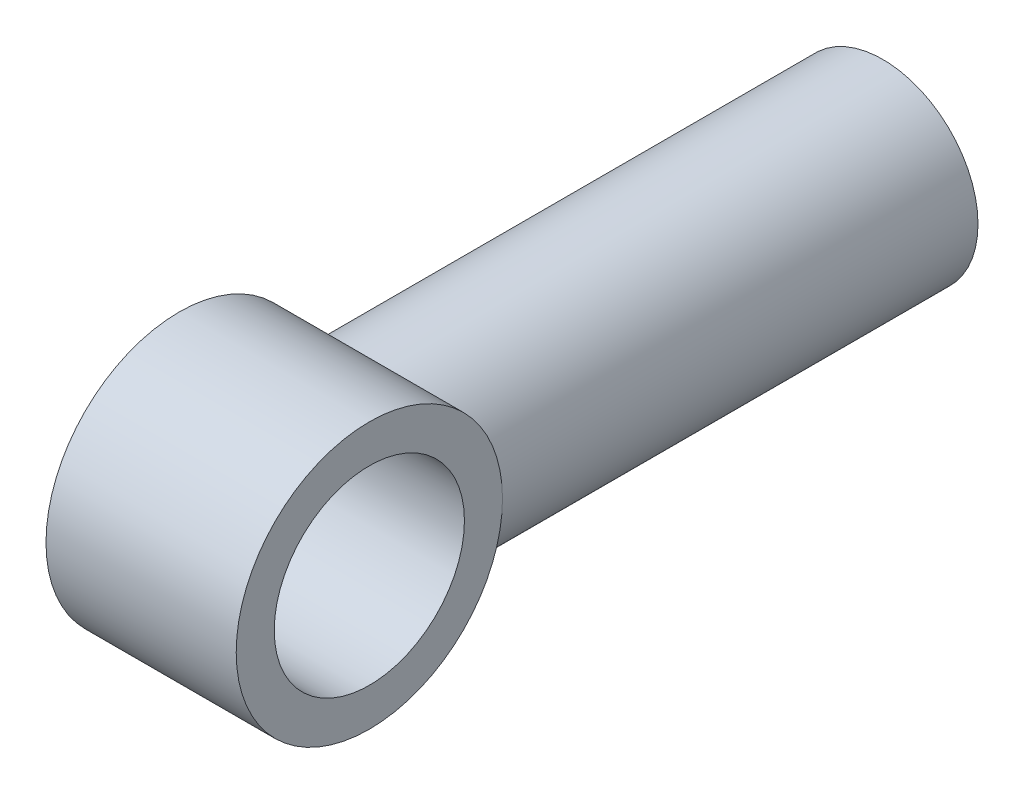
ISO-10303-21;
HEADER;
FILE_DESCRIPTION(('STEP AP214'),'2;1');
FILE_NAME('part.step','',(''),(''),'','','');
FILE_SCHEMA(('AUTOMOTIVE_DESIGN { 1 0 10303 214 1 1 1 1 }'));
ENDSEC;
DATA;
#1=APPLICATION_CONTEXT('core data for automotive mechanical design processes');
#2=APPLICATION_PROTOCOL_DEFINITION('international standard','automotive_design',2000,#1);
#3=PRODUCT_CONTEXT('',#1,'mechanical');
#4=PRODUCT('Part','Part','',(#3));
#5=PRODUCT_RELATED_PRODUCT_CATEGORY('part','',(#4));
#6=PRODUCT_DEFINITION_FORMATION('','',#4);
#7=PRODUCT_DEFINITION_CONTEXT('part definition',#1,'design');
#8=PRODUCT_DEFINITION('design','',#6,#7);
#9=PRODUCT_DEFINITION_SHAPE('','',#8);
#10=(LENGTH_UNIT() NAMED_UNIT(*) SI_UNIT(.MILLI.,.METRE.));
#11=(NAMED_UNIT(*) PLANE_ANGLE_UNIT() SI_UNIT($,.RADIAN.));
#12=(NAMED_UNIT(*) SI_UNIT($,.STERADIAN.) SOLID_ANGLE_UNIT());
#13=UNCERTAINTY_MEASURE_WITH_UNIT(LENGTH_MEASURE(1.E-05),#10,'distance_accuracy_value','');
#14=(GEOMETRIC_REPRESENTATION_CONTEXT(3) GLOBAL_UNCERTAINTY_ASSIGNED_CONTEXT((#13)) GLOBAL_UNIT_ASSIGNED_CONTEXT((#10,
#11,#12)) REPRESENTATION_CONTEXT('',''));
#15=CARTESIAN_POINT('',(0.,0.,0.));
#16=DIRECTION('',(0.,0.,1.));
#17=DIRECTION('',(1.,0.,0.));
#18=AXIS2_PLACEMENT_3D('',#15,#16,#17);
#19=CARTESIAN_POINT('',(3.175,0.,0.));
#20=DIRECTION('',(-1.,0.,0.));
#21=DIRECTION('',(0.,0.,1.));
#22=AXIS2_PLACEMENT_3D('',#19,#20,#21);
#23=CYLINDRICAL_SURFACE('',#22,4.445);
#24=CARTESIAN_POINT('',(3.17499999999998,0.,-4.445));
#25=CARTESIAN_POINT('',(3.17500045964919,-0.157135345690454,-4.44500068146169));
#26=CARTESIAN_POINT('',(3.16326784936826,-0.314264695933462,-4.43659739655863));
#27=CARTESIAN_POINT('',(3.11711518775272,-0.623439378001871,-4.40381046159461));
#28=CARTESIAN_POINT('',(3.08268526513322,-0.775482467517806,-4.37941985851772));
#29=CARTESIAN_POINT('',(2.99337447106168,-1.06951031993426,-4.31702204892824));
#30=CARTESIAN_POINT('',(2.93859592046098,-1.21154124689257,-4.27908300555363));
#31=CARTESIAN_POINT('',(2.81104767490878,-1.48365791708574,-4.19251669423569));
#32=CARTESIAN_POINT('',(2.7382755699989,-1.61374205702991,-4.14388799467509));
#33=CARTESIAN_POINT('',(2.56983185931845,-1.87146569941416,-4.03447201061871));
#34=CARTESIAN_POINT('',(2.47269228627367,-1.99784078549901,-3.97298557684852));
#35=CARTESIAN_POINT('',(2.2619493513509,-2.23366824543392,-3.8453538470804));
#36=CARTESIAN_POINT('',(2.14832133183854,-2.34309475772077,-3.77920165119487));
#37=CARTESIAN_POINT('',(1.95558944919742,-2.50299051017439,-3.67398192732405));
#38=CARTESIAN_POINT('',(1.88129258997702,-2.55931026254697,-3.63486559549201));
#39=CARTESIAN_POINT('',(1.72763964967273,-2.6654488798687,-3.55776896432843));
#40=CARTESIAN_POINT('',(1.6482821979517,-2.71526597237644,-3.51978897689761));
#41=CARTESIAN_POINT('',(1.40297683284193,-2.85439036336254,-3.40945492571689));
#42=CARTESIAN_POINT('',(1.22942424071437,-2.93368114625014,-3.34049226541055));
#43=CARTESIAN_POINT('',(0.923196947054475,-3.0406456811152,-3.24283714301298));
#44=CARTESIAN_POINT('',(0.795290150967088,-3.07671836514147,-3.20832430819869));
#45=CARTESIAN_POINT('',(0.533126960181833,-3.13277503431814,-3.15361656217548));
#46=CARTESIAN_POINT('',(0.398884677128958,-3.15279314022328,-3.13339129660048));
#47=CARTESIAN_POINT('',(0.126492369779067,-3.17543562714864,-3.11045536719717));
#48=CARTESIAN_POINT('',(-0.0116772694001373,-3.17794702829424,-3.10785847122045));
#49=CARTESIAN_POINT('',(-0.286340154836318,-3.1650558625028,-3.12097884331295));
#50=CARTESIAN_POINT('',(-0.422831922198554,-3.14963849762627,-3.13671123992595));
#51=CARTESIAN_POINT('',(-0.707068292395042,-3.09905197005017,-3.18673530405887));
#52=CARTESIAN_POINT('',(-0.854019399674728,-3.0616087927839,-3.22314331149823));
#53=CARTESIAN_POINT('',(-1.13761676864169,-2.96797542374644,-3.30956011648952));
#54=CARTESIAN_POINT('',(-1.27423936363188,-2.91174368672785,-3.35959900894292));
#55=CARTESIAN_POINT('',(-1.57667078474811,-2.7624841869375,-3.48407583860094));
#56=CARTESIAN_POINT('',(-1.7384022671493,-2.66345367809461,-3.56126926169923));
#57=CARTESIAN_POINT('',(-1.96523737543923,-2.49546071466058,-3.67905325509913));
#58=CARTESIAN_POINT('',(-2.03828078992712,-2.43615958901142,-3.71868353270507));
#59=CARTESIAN_POINT('',(-2.17893153290881,-2.31122076495171,-3.79759744769026));
#60=CARTESIAN_POINT('',(-2.24653860175233,-2.24558276420896,-3.83688106843285));
#61=CARTESIAN_POINT('',(-2.44205554328341,-2.03796614624733,-3.95347588392179));
#62=CARTESIAN_POINT('',(-2.56129588999667,-1.88629127758158,-4.02879132801684));
#63=CARTESIAN_POINT('',(-2.71937263675317,-1.64166414024874,-4.1316855757333));
#64=CARTESIAN_POINT('',(-2.76858315147266,-1.55731179684567,-4.16429122014675));
#65=CARTESIAN_POINT('',(-2.85953038891172,-1.38323882824111,-4.22530126269537));
#66=CARTESIAN_POINT('',(-2.90126992295567,-1.29352023938135,-4.25370724045877));
#67=CARTESIAN_POINT('',(-2.99496111029027,-1.06429426739449,-4.31804606138638));
#68=CARTESIAN_POINT('',(-3.04197620477585,-0.921831227979809,-4.35090049906725));
#69=CARTESIAN_POINT('',(-3.11564326881559,-0.6293690965414,-4.40272032805322));
#70=CARTESIAN_POINT('',(-3.14231003582932,-0.47937556551234,-4.42169581182264));
#71=CARTESIAN_POINT('',(-3.17383772437397,-0.175435542142042,-4.44415567043381));
#72=CARTESIAN_POINT('',(-3.17862947055822,-0.0214780558641051,-4.44759090204886));
#73=CARTESIAN_POINT('',(-3.16589865790746,0.285036073303244,-4.43850144348559));
#74=CARTESIAN_POINT('',(-3.14837372862276,0.437592565647085,-4.42597505788392));
#75=CARTESIAN_POINT('',(-3.09345367061143,0.729515179991223,-4.38708387069533));
#76=CARTESIAN_POINT('',(-3.05704484788875,0.869163458922513,-4.36140670188928));
#77=CARTESIAN_POINT('',(-2.96675118835914,1.13991128382523,-4.29860015071631));
#78=CARTESIAN_POINT('',(-2.91286280734965,1.27100908959924,-4.26146844587147));
#79=CARTESIAN_POINT('',(-2.78402428543244,1.53401164556839,-4.17441350177182));
#80=CARTESIAN_POINT('',(-2.70760560881418,1.66490795868587,-4.12363470440702));
#81=CARTESIAN_POINT('',(-2.53874190708081,1.91256849724282,-4.01477805597365));
#82=CARTESIAN_POINT('',(-2.44628445692201,2.02932164616568,-3.95669455570624));
#83=CARTESIAN_POINT('',(-2.22914522080758,2.2676051863268,-3.82591561039413));
#84=CARTESIAN_POINT('',(-2.10165982238922,2.38617549546956,-3.75247824490861));
#85=CARTESIAN_POINT('',(-1.82862844716676,2.60134233804902,-3.6066498178493));
#86=CARTESIAN_POINT('',(-1.68307290092945,2.69792715122377,-3.53425933352353));
#87=CARTESIAN_POINT('',(-1.39879971856191,2.8541272161865,-3.40887194703443));
#88=CARTESIAN_POINT('',(-1.26252459619772,2.91715329199723,-3.3546086535031));
#89=CARTESIAN_POINT('',(-0.978660985741491,3.02419231184678,-3.25844754716593));
#90=CARTESIAN_POINT('',(-0.83109721914056,3.06824547698383,-3.21652363620148));
#91=CARTESIAN_POINT('',(-0.555393678523282,3.12860760979771,-3.15773522667382));
#92=CARTESIAN_POINT('',(-0.42875531542085,3.1485558607941,-3.13765763912142));
#93=CARTESIAN_POINT('',(-0.172546801665676,3.1729104135385,-3.11303544928366));
#94=CARTESIAN_POINT('',(-0.0429800817410187,3.17733404070829,-3.10847353174467));
#95=CARTESIAN_POINT('',(0.215254554741081,3.17032863993121,-3.11561503539182));
#96=CARTESIAN_POINT('',(0.343922409846359,3.15889853857781,-3.127319557928));
#97=CARTESIAN_POINT('',(0.596917917334661,3.12101544445271,-3.16511878357131));
#98=CARTESIAN_POINT('',(0.721238538740617,3.09453921093339,-3.19123574679514));
#99=CARTESIAN_POINT('',(1.0041976405938,3.01669516022413,-3.26516715147605));
#100=CARTESIAN_POINT('',(1.16019174059299,2.95993301109254,-3.3173349374837));
#101=CARTESIAN_POINT('',(1.4581546626424,2.82511343871106,-3.4328752462651));
#102=CARTESIAN_POINT('',(1.60009963165899,2.74702061679844,-3.49626633224899));
#103=CARTESIAN_POINT('',(1.87281477305587,2.56912306918348,-3.62909163627679));
#104=CARTESIAN_POINT('',(2.00318164587607,2.46879081622876,-3.69864254201248));
#105=CARTESIAN_POINT('',(2.24740696980876,2.24872933764268,-3.83641575839731));
#106=CARTESIAN_POINT('',(2.36125972278529,2.12899344688695,-3.90463760346325));
#107=CARTESIAN_POINT('',(2.52706766289521,1.92458168073321,-4.00764148399395));
#108=CARTESIAN_POINT('',(2.58514727918591,1.84588796987316,-4.04458372400266));
#109=CARTESIAN_POINT('',(2.69435339557554,1.68247888032707,-4.11524025567883));
#110=CARTESIAN_POINT('',(2.74548321545109,1.59776640633826,-4.14895608624232));
#111=CARTESIAN_POINT('',(2.84010416307998,1.4227821674067,-4.2121674246624));
#112=CARTESIAN_POINT('',(2.88360287598244,1.33251604463305,-4.2416671177961));
#113=CARTESIAN_POINT('',(2.96228341125025,1.14702292614422,-4.29554475029446));
#114=CARTESIAN_POINT('',(2.99746845970105,1.05179787228693,-4.31992467595527));
#115=CARTESIAN_POINT('',(3.07603025279277,0.802476586002146,-4.37471835079486));
#116=CARTESIAN_POINT('',(3.1129478339349,0.645294183223843,-4.40085699047611));
#117=CARTESIAN_POINT('',(3.16242059567295,0.325402014020016,-4.43598910603987));
#118=CARTESIAN_POINT('',(3.17499952407961,0.162697793296492,-4.44499929441519));
#119=CARTESIAN_POINT('',(3.17499999999998,0.,-4.445));
#120=B_SPLINE_CURVE_WITH_KNOTS('',3,(#24,#25,#26,#27,#28,#29,#30,#31,#32,#33,#34,#35,#36,#37,
#38,#39,#40,#41,#42,#43,#44,#45,#46,#47,#48,#49,#50,#51,#52,#53,#54,#55,#56,#57,#58,#59,#60,#61,
#62,#63,#64,#65,#66,#67,#68,#69,#70,#71,#72,#73,#74,#75,#76,#77,#78,#79,#80,#81,#82,#83,#84,#85,
#86,#87,#88,#89,#90,#91,#92,#93,#94,#95,#96,#97,#98,#99,#100,#101,#102,#103,#104,#105,#106,#107,
#108,#109,#110,#111,#112,#113,#114,#115,#116,#117,#118,#119),.UNSPECIFIED.,.T.,.F.,(4,2,2,2,2,2,
2,2,2,2,2,2,2,2,2,2,2,2,2,2,2,2,2,2,2,2,2,2,2,2,2,2,2,2,2,2,2,2,2,2,2,2,2,2,2,2,2,4),(0.,
0.470761773387411,0.941728420901217,1.41035823318545,1.87905084521829,2.38975724688184,
2.90123540900895,3.2042249900184,3.50729698573711,4.11187024161111,4.52231828310969,
4.93189167144032,5.3441058230714,5.75666044722062,6.22197984742601,6.68833504678566,
7.29922376132405,7.60522045092208,7.91123174683798,8.52874256985675,8.8372157972748,
9.14557270129032,9.60420610232046,10.0625056629378,10.5222535042108,10.9820501834052,
11.4199439492373,11.8579265591553,12.3356942377202,12.8138337036218,13.3785140282358,
13.9434946773142,14.420823415074,14.8971352116425,15.2847301731364,15.6718924423201,
16.0590809263333,16.4468691062568,16.9660482627593,17.4860942973884,18.0201291482468,
18.5543478297358,18.8676105626928,19.1807231265412,19.493522678085,19.8062006488912,
20.2941032576449,20.7815295675049),.UNSPECIFIED.);
#121=CARTESIAN_POINT('',(3.17499999999998,0.,-4.445));
#122=VERTEX_POINT('',#121);
#123=CARTESIAN_POINT('',(-3.175,0.,-4.445));
#124=VERTEX_POINT('',#123);
#125=EDGE_CURVE('E11',#122,#124,#120,.T.);
#126=ORIENTED_EDGE('',*,*,#125,.F.);
#127=CARTESIAN_POINT('',(3.175,0.,0.));
#128=DIRECTION('',(1.,0.,0.));
#129=DIRECTION('',(0.,0.,-1.));
#130=AXIS2_PLACEMENT_3D('',#127,#128,#129);
#131=CIRCLE('',#130,4.445);
#132=EDGE_CURVE('E51',#122,#122,#131,.T.);
#133=ORIENTED_EDGE('',*,*,#132,.F.);
#134=EDGE_CURVE('E37',#124,#122,#120,.T.);
#135=ORIENTED_EDGE('',*,*,#134,.F.);
#136=CARTESIAN_POINT('',(-3.175,0.,0.));
#137=DIRECTION('',(1.,0.,0.));
#138=DIRECTION('',(0.,0.,-1.));
#139=AXIS2_PLACEMENT_3D('',#136,#137,#138);
#140=CIRCLE('',#139,4.445);
#141=EDGE_CURVE('E55',#124,#124,#140,.T.);
#142=ORIENTED_EDGE('',*,*,#141,.T.);
#143=EDGE_LOOP('',(#126,#133,#135,#142));
#144=FACE_BOUND('',#143,.T.);
#145=ADVANCED_FACE('F32',(#144),#23,.T.);
#146=CARTESIAN_POINT('',(3.175,0.,0.));
#147=DIRECTION('',(1.,0.,0.));
#148=DIRECTION('',(0.,0.,-1.));
#149=AXIS2_PLACEMENT_3D('',#146,#147,#148);
#150=PLANE('',#149);
#151=CARTESIAN_POINT('',(3.175,0.,0.));
#152=DIRECTION('',(1.,0.,0.));
#153=DIRECTION('',(0.,0.,-1.));
#154=AXIS2_PLACEMENT_3D('',#151,#152,#153);
#155=CIRCLE('',#154,3.175);
#156=CARTESIAN_POINT('',(3.175,0.,-3.175));
#157=VERTEX_POINT('',#156);
#158=EDGE_CURVE('E65',#157,#157,#155,.T.);
#159=ORIENTED_EDGE('',*,*,#158,.F.);
#160=EDGE_LOOP('',(#159));
#161=FACE_BOUND('',#160,.T.);
#162=ORIENTED_EDGE('',*,*,#132,.T.);
#163=EDGE_LOOP('',(#162));
#164=FACE_BOUND('',#163,.T.);
#165=ADVANCED_FACE('F81',(#161,#164),#150,.T.);
#166=CARTESIAN_POINT('',(-3.175,0.,0.));
#167=DIRECTION('',(1.,0.,0.));
#168=DIRECTION('',(0.,0.,-1.));
#169=AXIS2_PLACEMENT_3D('',#166,#167,#168);
#170=PLANE('',#169);
#171=CARTESIAN_POINT('',(-3.175,0.,0.));
#172=DIRECTION('',(1.,0.,0.));
#173=DIRECTION('',(0.,0.,-1.));
#174=AXIS2_PLACEMENT_3D('',#171,#172,#173);
#175=CIRCLE('',#174,3.175);
#176=CARTESIAN_POINT('',(-3.175,0.,-3.175));
#177=VERTEX_POINT('',#176);
#178=EDGE_CURVE('E63',#177,#177,#175,.T.);
#179=ORIENTED_EDGE('',*,*,#178,.T.);
#180=EDGE_LOOP('',(#179));
#181=FACE_BOUND('',#180,.T.);
#182=ORIENTED_EDGE('',*,*,#141,.F.);
#183=EDGE_LOOP('',(#182));
#184=FACE_BOUND('',#183,.T.);
#185=ADVANCED_FACE('F71',(#181,#184),#170,.F.);
#186=CARTESIAN_POINT('',(0.,0.,-20.32));
#187=DIRECTION('',(0.,0.,1.));
#188=DIRECTION('',(1.,0.,0.));
#189=AXIS2_PLACEMENT_3D('',#186,#187,#188);
#190=CYLINDRICAL_SURFACE('',#189,3.17499999999998);
#191=CARTESIAN_POINT('',(0.,0.,-20.32));
#192=DIRECTION('',(0.,0.,1.));
#193=DIRECTION('',(1.,0.,0.));
#194=AXIS2_PLACEMENT_3D('',#191,#192,#193);
#195=CIRCLE('',#194,3.17499999999998);
#196=CARTESIAN_POINT('',(3.17499999999998,0.,-20.32));
#197=VERTEX_POINT('',#196);
#198=EDGE_CURVE('E57',#197,#197,#195,.T.);
#199=ORIENTED_EDGE('',*,*,#198,.T.);
#200=EDGE_LOOP('',(#199));
#201=FACE_BOUND('',#200,.T.);
#202=ORIENTED_EDGE('',*,*,#134,.T.);
#203=ORIENTED_EDGE('',*,*,#125,.T.);
#204=EDGE_LOOP('',(#202,#203));
#205=FACE_BOUND('',#204,.T.);
#206=ADVANCED_FACE('F34',(#201,#205),#190,.T.);
#207=CARTESIAN_POINT('',(0.,0.,-20.32));
#208=DIRECTION('',(0.,0.,1.));
#209=DIRECTION('',(1.,0.,0.));
#210=AXIS2_PLACEMENT_3D('',#207,#208,#209);
#211=PLANE('',#210);
#212=ORIENTED_EDGE('',*,*,#198,.F.);
#213=EDGE_LOOP('',(#212));
#214=FACE_BOUND('',#213,.T.);
#215=ADVANCED_FACE('F77',(#214),#211,.F.);
#216=CARTESIAN_POINT('',(-3.175,0.,0.));
#217=DIRECTION('',(1.,0.,0.));
#218=DIRECTION('',(0.,0.,-1.));
#219=AXIS2_PLACEMENT_3D('',#216,#217,#218);
#220=CYLINDRICAL_SURFACE('',#219,3.175);
#221=ORIENTED_EDGE('',*,*,#178,.F.);
#222=EDGE_LOOP('',(#221));
#223=FACE_BOUND('',#222,.T.);
#224=ORIENTED_EDGE('',*,*,#158,.T.);
#225=EDGE_LOOP('',(#224));
#226=FACE_BOUND('',#225,.T.);
#227=ADVANCED_FACE('F74',(#223,#226),#220,.F.);
#228=CLOSED_SHELL('',(#145,#165,#185,#206,#215,#227));
#229=MANIFOLD_SOLID_BREP('B2',#228);
#230=ADVANCED_BREP_SHAPE_REPRESENTATION('',(#18,#229),#14);
#231=SHAPE_DEFINITION_REPRESENTATION(#9,#230);
ENDSEC;
END-ISO-10303-21;
